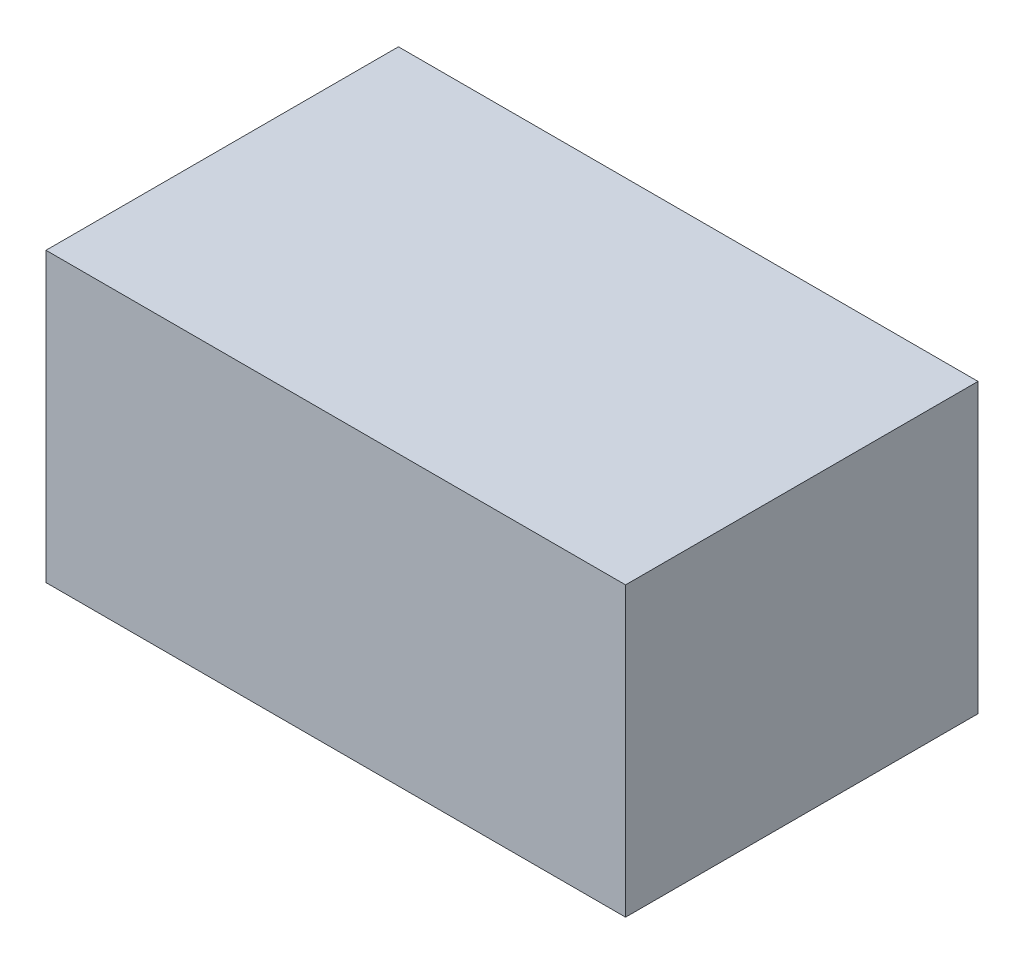
ISO-10303-21;
HEADER;
FILE_DESCRIPTION(('STEP AP214'),'2;1');
FILE_NAME('part.step','',(''),(''),'','','');
FILE_SCHEMA(('AUTOMOTIVE_DESIGN { 1 0 10303 214 1 1 1 1 }'));
ENDSEC;
DATA;
#1=APPLICATION_CONTEXT('core data for automotive mechanical design processes');
#2=APPLICATION_PROTOCOL_DEFINITION('international standard','automotive_design',2000,#1);
#3=PRODUCT_CONTEXT('',#1,'mechanical');
#4=PRODUCT('Part','Part','',(#3));
#5=PRODUCT_RELATED_PRODUCT_CATEGORY('part','',(#4));
#6=PRODUCT_DEFINITION_FORMATION('','',#4);
#7=PRODUCT_DEFINITION_CONTEXT('part definition',#1,'design');
#8=PRODUCT_DEFINITION('design','',#6,#7);
#9=PRODUCT_DEFINITION_SHAPE('','',#8);
#10=(LENGTH_UNIT() NAMED_UNIT(*) SI_UNIT(.MILLI.,.METRE.));
#11=(NAMED_UNIT(*) PLANE_ANGLE_UNIT() SI_UNIT($,.RADIAN.));
#12=(NAMED_UNIT(*) SI_UNIT($,.STERADIAN.) SOLID_ANGLE_UNIT());
#13=UNCERTAINTY_MEASURE_WITH_UNIT(LENGTH_MEASURE(1.E-05),#10,'distance_accuracy_value','');
#14=(GEOMETRIC_REPRESENTATION_CONTEXT(3) GLOBAL_UNCERTAINTY_ASSIGNED_CONTEXT((#13)) GLOBAL_UNIT_ASSIGNED_CONTEXT((#10,
#11,#12)) REPRESENTATION_CONTEXT('',''));
#15=CARTESIAN_POINT('',(0.,0.,0.));
#16=DIRECTION('',(0.,0.,1.));
#17=DIRECTION('',(1.,0.,0.));
#18=AXIS2_PLACEMENT_3D('',#15,#16,#17);
#19=CARTESIAN_POINT('',(0.,0.,9.));
#20=DIRECTION('',(1.,0.,0.));
#21=DIRECTION('',(0.,1.,0.));
#22=AXIS2_PLACEMENT_3D('',#19,#20,#21);
#23=PLANE('',#22);
#24=DIRECTION('',(0.,-1.,0.));
#25=VECTOR('',#24,1.);
#26=CARTESIAN_POINT('',(0.,0.,0.));
#27=LINE('',#26,#25);
#28=CARTESIAN_POINT('',(0.,7.35,0.));
#29=VERTEX_POINT('',#28);
#30=CARTESIAN_POINT('',(0.,0.,0.));
#31=VERTEX_POINT('',#30);
#32=EDGE_CURVE('E96',#29,#31,#27,.T.);
#33=ORIENTED_EDGE('',*,*,#32,.T.);
#34=DIRECTION('',(0.,0.,-1.));
#35=VECTOR('',#34,1.);
#36=CARTESIAN_POINT('',(0.,0.,9.));
#37=LINE('',#36,#35);
#38=CARTESIAN_POINT('',(0.,0.,9.));
#39=VERTEX_POINT('',#38);
#40=EDGE_CURVE('E11',#39,#31,#37,.T.);
#41=ORIENTED_EDGE('',*,*,#40,.F.);
#42=DIRECTION('',(0.,-1.,0.));
#43=VECTOR('',#42,1.);
#44=CARTESIAN_POINT('',(0.,0.,9.));
#45=LINE('',#44,#43);
#46=CARTESIAN_POINT('',(0.,7.35,9.));
#47=VERTEX_POINT('',#46);
#48=EDGE_CURVE('E84',#47,#39,#45,.T.);
#49=ORIENTED_EDGE('',*,*,#48,.F.);
#50=DIRECTION('',(0.,0.,-1.));
#51=VECTOR('',#50,1.);
#52=CARTESIAN_POINT('',(0.,7.35,9.));
#53=LINE('',#52,#51);
#54=EDGE_CURVE('E92',#47,#29,#53,.T.);
#55=ORIENTED_EDGE('',*,*,#54,.T.);
#56=EDGE_LOOP('',(#33,#41,#49,#55));
#57=FACE_BOUND('',#56,.T.);
#58=ADVANCED_FACE('F33',(#57),#23,.F.);
#59=CARTESIAN_POINT('',(0.,0.,9.));
#60=DIRECTION('',(0.,1.,0.));
#61=DIRECTION('',(0.,0.,1.));
#62=AXIS2_PLACEMENT_3D('',#59,#60,#61);
#63=PLANE('',#62);
#64=DIRECTION('',(1.,0.,0.));
#65=VECTOR('',#64,1.);
#66=CARTESIAN_POINT('',(0.,0.,0.));
#67=LINE('',#66,#65);
#68=CARTESIAN_POINT('',(14.8,0.,0.));
#69=VERTEX_POINT('',#68);
#70=EDGE_CURVE('E88',#31,#69,#67,.T.);
#71=ORIENTED_EDGE('',*,*,#70,.T.);
#72=DIRECTION('',(0.,0.,-1.));
#73=VECTOR('',#72,1.);
#74=CARTESIAN_POINT('',(14.8,0.,9.));
#75=LINE('',#74,#73);
#76=CARTESIAN_POINT('',(14.8,0.,9.));
#77=VERTEX_POINT('',#76);
#78=EDGE_CURVE('E41',#77,#69,#75,.T.);
#79=ORIENTED_EDGE('',*,*,#78,.F.);
#80=DIRECTION('',(1.,0.,0.));
#81=VECTOR('',#80,1.);
#82=CARTESIAN_POINT('',(0.,0.,9.));
#83=LINE('',#82,#81);
#84=EDGE_CURVE('E79',#39,#77,#83,.T.);
#85=ORIENTED_EDGE('',*,*,#84,.F.);
#86=ORIENTED_EDGE('',*,*,#40,.T.);
#87=EDGE_LOOP('',(#71,#79,#85,#86));
#88=FACE_BOUND('',#87,.T.);
#89=ADVANCED_FACE('F87',(#88),#63,.F.);
#90=CARTESIAN_POINT('',(14.8,0.,9.));
#91=DIRECTION('',(-1.,0.,0.));
#92=DIRECTION('',(0.,-1.,0.));
#93=AXIS2_PLACEMENT_3D('',#90,#91,#92);
#94=PLANE('',#93);
#95=DIRECTION('',(0.,1.,0.));
#96=VECTOR('',#95,1.);
#97=CARTESIAN_POINT('',(14.8,0.,0.));
#98=LINE('',#97,#96);
#99=CARTESIAN_POINT('',(14.8,7.35,0.));
#100=VERTEX_POINT('',#99);
#101=EDGE_CURVE('E66',#69,#100,#98,.T.);
#102=ORIENTED_EDGE('',*,*,#101,.T.);
#103=DIRECTION('',(0.,0.,-1.));
#104=VECTOR('',#103,1.);
#105=CARTESIAN_POINT('',(14.8,7.35,9.));
#106=LINE('',#105,#104);
#107=CARTESIAN_POINT('',(14.8,7.35,9.));
#108=VERTEX_POINT('',#107);
#109=EDGE_CURVE('E89',#108,#100,#106,.T.);
#110=ORIENTED_EDGE('',*,*,#109,.F.);
#111=DIRECTION('',(0.,1.,0.));
#112=VECTOR('',#111,1.);
#113=CARTESIAN_POINT('',(14.8,0.,9.));
#114=LINE('',#113,#112);
#115=EDGE_CURVE('E82',#77,#108,#114,.T.);
#116=ORIENTED_EDGE('',*,*,#115,.F.);
#117=ORIENTED_EDGE('',*,*,#78,.T.);
#118=EDGE_LOOP('',(#102,#110,#116,#117));
#119=FACE_BOUND('',#118,.T.);
#120=ADVANCED_FACE('F90',(#119),#94,.F.);
#121=CARTESIAN_POINT('',(0.,7.35,9.));
#122=DIRECTION('',(0.,-1.,0.));
#123=DIRECTION('',(0.,0.,-1.));
#124=AXIS2_PLACEMENT_3D('',#121,#122,#123);
#125=PLANE('',#124);
#126=DIRECTION('',(-1.,0.,0.));
#127=VECTOR('',#126,1.);
#128=CARTESIAN_POINT('',(0.,7.35,0.));
#129=LINE('',#128,#127);
#130=EDGE_CURVE('E72',#100,#29,#129,.T.);
#131=ORIENTED_EDGE('',*,*,#130,.T.);
#132=ORIENTED_EDGE('',*,*,#54,.F.);
#133=DIRECTION('',(-1.,0.,0.));
#134=VECTOR('',#133,1.);
#135=CARTESIAN_POINT('',(0.,7.35,9.));
#136=LINE('',#135,#134);
#137=EDGE_CURVE('E49',#108,#47,#136,.T.);
#138=ORIENTED_EDGE('',*,*,#137,.F.);
#139=ORIENTED_EDGE('',*,*,#109,.T.);
#140=EDGE_LOOP('',(#131,#132,#138,#139));
#141=FACE_BOUND('',#140,.T.);
#142=ADVANCED_FACE('F103',(#141),#125,.F.);
#143=CARTESIAN_POINT('',(0.,0.,9.));
#144=DIRECTION('',(0.,0.,-1.));
#145=DIRECTION('',(-1.,0.,0.));
#146=AXIS2_PLACEMENT_3D('',#143,#144,#145);
#147=PLANE('',#146);
#148=ORIENTED_EDGE('',*,*,#48,.T.);
#149=ORIENTED_EDGE('',*,*,#84,.T.);
#150=ORIENTED_EDGE('',*,*,#115,.T.);
#151=ORIENTED_EDGE('',*,*,#137,.T.);
#152=EDGE_LOOP('',(#148,#149,#150,#151));
#153=FACE_BOUND('',#152,.T.);
#154=ADVANCED_FACE('F80',(#153),#147,.F.);
#155=CARTESIAN_POINT('',(0.,0.,0.));
#156=DIRECTION('',(0.,0.,-1.));
#157=DIRECTION('',(-1.,0.,0.));
#158=AXIS2_PLACEMENT_3D('',#155,#156,#157);
#159=PLANE('',#158);
#160=ORIENTED_EDGE('',*,*,#32,.F.);
#161=ORIENTED_EDGE('',*,*,#130,.F.);
#162=ORIENTED_EDGE('',*,*,#101,.F.);
#163=ORIENTED_EDGE('',*,*,#70,.F.);
#164=EDGE_LOOP('',(#160,#161,#162,#163));
#165=FACE_BOUND('',#164,.T.);
#166=ADVANCED_FACE('F106',(#165),#159,.T.);
#167=CLOSED_SHELL('',(#58,#89,#120,#142,#154,#166));
#168=MANIFOLD_SOLID_BREP('B2',#167);
#169=ADVANCED_BREP_SHAPE_REPRESENTATION('',(#18,#168),#14);
#170=SHAPE_DEFINITION_REPRESENTATION(#9,#169);
ENDSEC;
END-ISO-10303-21;
